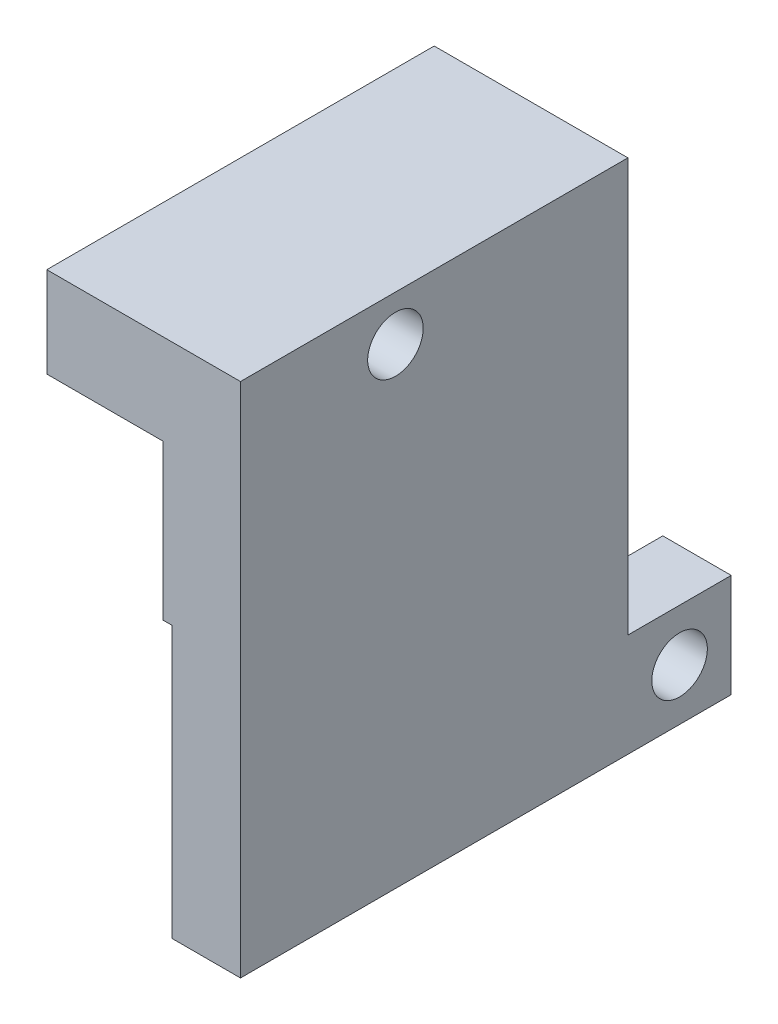
ISO-10303-21;
HEADER;
FILE_DESCRIPTION(('STEP AP214'),'2;1');
FILE_NAME('part.step','',(''),(''),'','','');
FILE_SCHEMA(('AUTOMOTIVE_DESIGN { 1 0 10303 214 1 1 1 1 }'));
ENDSEC;
DATA;
#1=APPLICATION_CONTEXT('core data for automotive mechanical design processes');
#2=APPLICATION_PROTOCOL_DEFINITION('international standard','automotive_design',2000,#1);
#3=PRODUCT_CONTEXT('',#1,'mechanical');
#4=PRODUCT('Part','Part','',(#3));
#5=PRODUCT_RELATED_PRODUCT_CATEGORY('part','',(#4));
#6=PRODUCT_DEFINITION_FORMATION('','',#4);
#7=PRODUCT_DEFINITION_CONTEXT('part definition',#1,'design');
#8=PRODUCT_DEFINITION('design','',#6,#7);
#9=PRODUCT_DEFINITION_SHAPE('','',#8);
#10=(LENGTH_UNIT() NAMED_UNIT(*) SI_UNIT(.MILLI.,.METRE.));
#11=(NAMED_UNIT(*) PLANE_ANGLE_UNIT() SI_UNIT($,.RADIAN.));
#12=(NAMED_UNIT(*) SI_UNIT($,.STERADIAN.) SOLID_ANGLE_UNIT());
#13=UNCERTAINTY_MEASURE_WITH_UNIT(LENGTH_MEASURE(1.E-05),#10,'distance_accuracy_value','');
#14=(GEOMETRIC_REPRESENTATION_CONTEXT(3) GLOBAL_UNCERTAINTY_ASSIGNED_CONTEXT((#13)) GLOBAL_UNIT_ASSIGNED_CONTEXT((#10,
#11,#12)) REPRESENTATION_CONTEXT('',''));
#15=CARTESIAN_POINT('',(0.,0.,0.));
#16=DIRECTION('',(0.,0.,1.));
#17=DIRECTION('',(1.,0.,0.));
#18=AXIS2_PLACEMENT_3D('',#15,#16,#17);
#19=CARTESIAN_POINT('',(4.83870967741938,-20.,0.));
#20=DIRECTION('',(0.,1.,0.));
#21=DIRECTION('',(0.,0.,1.));
#22=AXIS2_PLACEMENT_3D('',#19,#20,#21);
#23=PLANE('',#22);
#24=DIRECTION('',(1.,0.,0.));
#25=VECTOR('',#24,1.);
#26=CARTESIAN_POINT('',(11.4193548387097,-20.,-39.4516129032258));
#27=LINE('',#26,#25);
#28=CARTESIAN_POINT('',(12.1193548387097,-20.,-39.4516129032258));
#29=VERTEX_POINT('',#28);
#30=CARTESIAN_POINT('',(17.4193548387097,-20.,-39.4516129032258));
#31=VERTEX_POINT('',#30);
#32=EDGE_CURVE('E143',#29,#31,#27,.T.);
#33=ORIENTED_EDGE('',*,*,#32,.T.);
#34=DIRECTION('',(0.,0.,1.));
#35=VECTOR('',#34,1.);
#36=CARTESIAN_POINT('',(17.4193548387097,-20.,-31.4516129032258));
#37=LINE('',#36,#35);
#38=CARTESIAN_POINT('',(17.4193548387097,-20.,-1.45161290322579));
#39=VERTEX_POINT('',#38);
#40=EDGE_CURVE('E192',#31,#39,#37,.T.);
#41=ORIENTED_EDGE('',*,*,#40,.T.);
#42=DIRECTION('',(1.,0.,0.));
#43=VECTOR('',#42,1.);
#44=CARTESIAN_POINT('',(2.41835483870969,-20.,-1.45161290322578));
#45=LINE('',#44,#43);
#46=CARTESIAN_POINT('',(12.1193548387097,-20.,-1.45161290322579));
#47=VERTEX_POINT('',#46);
#48=EDGE_CURVE('E145',#47,#39,#45,.T.);
#49=ORIENTED_EDGE('',*,*,#48,.F.);
#50=DIRECTION('',(0.,0.,-1.));
#51=VECTOR('',#50,1.);
#52=CARTESIAN_POINT('',(12.1193548387097,-20.,-31.4516129032258));
#53=LINE('',#52,#51);
#54=EDGE_CURVE('E130',#47,#29,#53,.T.);
#55=ORIENTED_EDGE('',*,*,#54,.T.);
#56=EDGE_LOOP('',(#33,#41,#49,#55));
#57=FACE_BOUND('',#56,.T.);
#58=ADVANCED_FACE('F45',(#57),#23,.F.);
#59=CARTESIAN_POINT('',(11.4193548387097,-12.,-39.4516129032258));
#60=DIRECTION('',(0.,-1.,0.));
#61=DIRECTION('',(0.,0.,-1.));
#62=AXIS2_PLACEMENT_3D('',#59,#60,#61);
#63=PLANE('',#62);
#64=DIRECTION('',(0.,0.,1.));
#65=VECTOR('',#64,1.);
#66=CARTESIAN_POINT('',(12.1193548387097,-12.,-31.4516129032258));
#67=LINE('',#66,#65);
#68=CARTESIAN_POINT('',(12.1193548387097,-12.,-39.4516129032258));
#69=VERTEX_POINT('',#68);
#70=CARTESIAN_POINT('',(12.1193548387097,-12.,-31.4516129032258));
#71=VERTEX_POINT('',#70);
#72=EDGE_CURVE('E133',#69,#71,#67,.T.);
#73=ORIENTED_EDGE('',*,*,#72,.T.);
#74=DIRECTION('',(-1.,0.,0.));
#75=VECTOR('',#74,1.);
#76=CARTESIAN_POINT('',(11.4193548387097,-12.,-31.4516129032258));
#77=LINE('',#76,#75);
#78=CARTESIAN_POINT('',(17.4193548387097,-12.,-31.4516129032258));
#79=VERTEX_POINT('',#78);
#80=EDGE_CURVE('E153',#79,#71,#77,.T.);
#81=ORIENTED_EDGE('',*,*,#80,.F.);
#82=DIRECTION('',(0.,0.,1.));
#83=VECTOR('',#82,1.);
#84=CARTESIAN_POINT('',(17.4193548387097,-12.,-39.4516129032258));
#85=LINE('',#84,#83);
#86=CARTESIAN_POINT('',(17.4193548387097,-12.,-39.4516129032258));
#87=VERTEX_POINT('',#86);
#88=EDGE_CURVE('E166',#87,#79,#85,.T.);
#89=ORIENTED_EDGE('',*,*,#88,.F.);
#90=DIRECTION('',(-1.,0.,0.));
#91=VECTOR('',#90,1.);
#92=CARTESIAN_POINT('',(11.4193548387097,-12.,-39.4516129032258));
#93=LINE('',#92,#91);
#94=EDGE_CURVE('E157',#87,#69,#93,.T.);
#95=ORIENTED_EDGE('',*,*,#94,.T.);
#96=EDGE_LOOP('',(#73,#81,#89,#95));
#97=FACE_BOUND('',#96,.T.);
#98=ADVANCED_FACE('F303',(#97),#63,.F.);
#99=CARTESIAN_POINT('',(4.83870967741938,0.,-39.4516129032258));
#100=DIRECTION('',(0.,0.,-1.));
#101=DIRECTION('',(1.,0.,0.));
#102=AXIS2_PLACEMENT_3D('',#99,#100,#101);
#103=PLANE('',#102);
#104=ORIENTED_EDGE('',*,*,#94,.F.);
#105=DIRECTION('',(0.,1.,0.));
#106=VECTOR('',#105,1.);
#107=CARTESIAN_POINT('',(17.4193548387097,-12.,-39.4516129032258));
#108=LINE('',#107,#106);
#109=EDGE_CURVE('E150',#31,#87,#108,.T.);
#110=ORIENTED_EDGE('',*,*,#109,.F.);
#111=ORIENTED_EDGE('',*,*,#32,.F.);
#112=DIRECTION('',(0.,1.,0.));
#113=VECTOR('',#112,1.);
#114=CARTESIAN_POINT('',(12.1193548387097,-12.,-39.4516129032258));
#115=LINE('',#114,#113);
#116=EDGE_CURVE('E126',#29,#69,#115,.T.);
#117=ORIENTED_EDGE('',*,*,#116,.T.);
#118=EDGE_LOOP('',(#104,#110,#111,#117));
#119=FACE_BOUND('',#118,.T.);
#120=ADVANCED_FACE('F149',(#119),#103,.T.);
#121=CARTESIAN_POINT('',(2.41935483870969,-16.,-35.4516129032258));
#122=DIRECTION('',(1.,0.,0.));
#123=DIRECTION('',(0.,0.,1.));
#124=AXIS2_PLACEMENT_3D('',#121,#122,#123);
#125=CYLINDRICAL_SURFACE('',#124,2.15);
#126=CARTESIAN_POINT('',(17.4193548387097,-16.,-35.4516129032258));
#127=DIRECTION('',(-1.,0.,0.));
#128=DIRECTION('',(0.,0.,1.));
#129=AXIS2_PLACEMENT_3D('',#126,#127,#128);
#130=CIRCLE('',#129,2.15);
#131=CARTESIAN_POINT('',(17.4193548387097,-16.,-33.3016129032258));
#132=VERTEX_POINT('',#131);
#133=EDGE_CURVE('E160',#132,#132,#130,.T.);
#134=ORIENTED_EDGE('',*,*,#133,.F.);
#135=EDGE_LOOP('',(#134));
#136=FACE_BOUND('',#135,.T.);
#137=CARTESIAN_POINT('',(12.1193548387097,-16.,-35.4516129032258));
#138=DIRECTION('',(1.,0.,0.));
#139=DIRECTION('',(0.,0.,-1.));
#140=AXIS2_PLACEMENT_3D('',#137,#138,#139);
#141=CIRCLE('',#140,2.15);
#142=CARTESIAN_POINT('',(12.1193548387097,-16.,-37.6016129032258));
#143=VERTEX_POINT('',#142);
#144=EDGE_CURVE('E260',#143,#143,#141,.F.);
#145=ORIENTED_EDGE('',*,*,#144,.T.);
#146=EDGE_LOOP('',(#145));
#147=FACE_BOUND('',#146,.T.);
#148=ADVANCED_FACE('F253',(#136,#147),#125,.F.);
#149=CARTESIAN_POINT('',(11.4193548387097,20.,-31.4516129032258));
#150=DIRECTION('',(1.,0.,0.));
#151=DIRECTION('',(0.,0.,1.));
#152=AXIS2_PLACEMENT_3D('',#149,#150,#151);
#153=PLANE('',#152);
#154=DIRECTION('',(0.,1.,0.));
#155=VECTOR('',#154,1.);
#156=CARTESIAN_POINT('',(11.4193548387097,20.,-1.4516129032258));
#157=LINE('',#156,#155);
#158=CARTESIAN_POINT('',(11.4193548387097,0.999999999999997,-1.45161290322578));
#159=VERTEX_POINT('',#158);
#160=CARTESIAN_POINT('',(11.4193548387097,13.,-1.45161290322579));
#161=VERTEX_POINT('',#160);
#162=EDGE_CURVE('E216',#159,#161,#157,.T.);
#163=ORIENTED_EDGE('',*,*,#162,.T.);
#164=DIRECTION('',(0.,0.,-1.));
#165=VECTOR('',#164,1.);
#166=CARTESIAN_POINT('',(11.4193548387097,13.,3.5483870967742));
#167=LINE('',#166,#165);
#168=CARTESIAN_POINT('',(11.4193548387097,13.,-21.4516129032258));
#169=VERTEX_POINT('',#168);
#170=EDGE_CURVE('E176',#161,#169,#167,.T.);
#171=ORIENTED_EDGE('',*,*,#170,.T.);
#172=DIRECTION('',(0.,1.,0.));
#173=VECTOR('',#172,1.);
#174=CARTESIAN_POINT('',(11.4193548387097,1.,-21.4516129032258));
#175=LINE('',#174,#173);
#176=CARTESIAN_POINT('',(11.4193548387097,1.,-21.4516129032258));
#177=VERTEX_POINT('',#176);
#178=EDGE_CURVE('E236',#177,#169,#175,.T.);
#179=ORIENTED_EDGE('',*,*,#178,.F.);
#180=DIRECTION('',(0.,0.,1.));
#181=VECTOR('',#180,1.);
#182=CARTESIAN_POINT('',(11.4193548387097,1.,-31.4516129032258));
#183=LINE('',#182,#181);
#184=EDGE_CURVE('E262',#177,#159,#183,.T.);
#185=ORIENTED_EDGE('',*,*,#184,.T.);
#186=EDGE_LOOP('',(#163,#171,#179,#185));
#187=FACE_BOUND('',#186,.T.);
#188=ADVANCED_FACE('F256',(#187),#153,.F.);
#189=CARTESIAN_POINT('',(2.41935483870969,13.,3.5483870967742));
#190=DIRECTION('',(0.,1.,0.));
#191=DIRECTION('',(0.,0.,1.));
#192=AXIS2_PLACEMENT_3D('',#189,#190,#191);
#193=PLANE('',#192);
#194=DIRECTION('',(0.,0.,-1.));
#195=VECTOR('',#194,1.);
#196=CARTESIAN_POINT('',(2.41935483870969,13.,3.5483870967742));
#197=LINE('',#196,#195);
#198=CARTESIAN_POINT('',(2.41935483870969,13.,-1.45161290322579));
#199=VERTEX_POINT('',#198);
#200=CARTESIAN_POINT('',(2.41935483870969,13.,-21.4516129032258));
#201=VERTEX_POINT('',#200);
#202=EDGE_CURVE('E180',#199,#201,#197,.T.);
#203=ORIENTED_EDGE('',*,*,#202,.T.);
#204=DIRECTION('',(1.,0.,0.));
#205=VECTOR('',#204,1.);
#206=CARTESIAN_POINT('',(2.41935483870969,13.,-21.4516129032258));
#207=LINE('',#206,#205);
#208=EDGE_CURVE('E224',#201,#169,#207,.T.);
#209=ORIENTED_EDGE('',*,*,#208,.T.);
#210=ORIENTED_EDGE('',*,*,#170,.F.);
#211=DIRECTION('',(-1.,0.,0.));
#212=VECTOR('',#211,1.);
#213=CARTESIAN_POINT('',(2.41835483870969,13.,-1.45161290322579));
#214=LINE('',#213,#212);
#215=EDGE_CURVE('E212',#161,#199,#214,.T.);
#216=ORIENTED_EDGE('',*,*,#215,.T.);
#217=EDGE_LOOP('',(#203,#209,#210,#216));
#218=FACE_BOUND('',#217,.T.);
#219=ADVANCED_FACE('F291',(#218),#193,.F.);
#220=CARTESIAN_POINT('',(17.4193548387097,20.,-31.4516129032258));
#221=DIRECTION('',(0.,0.,1.));
#222=DIRECTION('',(-1.,0.,0.));
#223=AXIS2_PLACEMENT_3D('',#220,#221,#222);
#224=PLANE('',#223);
#225=DIRECTION('',(-1.,0.,0.));
#226=VECTOR('',#225,1.);
#227=CARTESIAN_POINT('',(2.41935483870969,1.,-31.4516129032258));
#228=LINE('',#227,#226);
#229=CARTESIAN_POINT('',(12.1193548387097,1.,-31.4516129032258));
#230=VERTEX_POINT('',#229);
#231=CARTESIAN_POINT('',(2.41935483870969,1.,-31.4516129032258));
#232=VERTEX_POINT('',#231);
#233=EDGE_CURVE('E232',#230,#232,#228,.T.);
#234=ORIENTED_EDGE('',*,*,#233,.T.);
#235=DIRECTION('',(0.,1.,0.));
#236=VECTOR('',#235,1.);
#237=CARTESIAN_POINT('',(2.41935483870969,20.,-31.4516129032258));
#238=LINE('',#237,#236);
#239=CARTESIAN_POINT('',(2.41935483870969,20.,-31.4516129032258));
#240=VERTEX_POINT('',#239);
#241=EDGE_CURVE('E184',#232,#240,#238,.T.);
#242=ORIENTED_EDGE('',*,*,#241,.T.);
#243=DIRECTION('',(1.,0.,0.));
#244=VECTOR('',#243,1.);
#245=CARTESIAN_POINT('',(17.4193548387097,20.,-31.4516129032258));
#246=LINE('',#245,#244);
#247=CARTESIAN_POINT('',(17.4193548387097,20.,-31.4516129032258));
#248=VERTEX_POINT('',#247);
#249=EDGE_CURVE('E54',#240,#248,#246,.T.);
#250=ORIENTED_EDGE('',*,*,#249,.T.);
#251=DIRECTION('',(0.,-1.,0.));
#252=VECTOR('',#251,1.);
#253=CARTESIAN_POINT('',(17.4193548387097,20.,-31.4516129032258));
#254=LINE('',#253,#252);
#255=EDGE_CURVE('E11',#248,#79,#254,.T.);
#256=ORIENTED_EDGE('',*,*,#255,.T.);
#257=ORIENTED_EDGE('',*,*,#80,.T.);
#258=DIRECTION('',(0.,1.,0.));
#259=VECTOR('',#258,1.);
#260=CARTESIAN_POINT('',(12.1193548387097,1.,-31.4516129032258));
#261=LINE('',#260,#259);
#262=EDGE_CURVE('E267',#71,#230,#261,.T.);
#263=ORIENTED_EDGE('',*,*,#262,.T.);
#264=EDGE_LOOP('',(#234,#242,#250,#256,#257,#263));
#265=FACE_BOUND('',#264,.T.);
#266=ADVANCED_FACE('F299',(#265),#224,.F.);
#267=CARTESIAN_POINT('',(17.4193548387097,20.,-31.4516129032258));
#268=DIRECTION('',(-1.,0.,0.));
#269=DIRECTION('',(0.,0.,-1.));
#270=AXIS2_PLACEMENT_3D('',#267,#268,#269);
#271=PLANE('',#270);
#272=ORIENTED_EDGE('',*,*,#133,.T.);
#273=EDGE_LOOP('',(#272));
#274=FACE_BOUND('',#273,.T.);
#275=CARTESIAN_POINT('',(17.4193548387097,16.5,-13.4516129032258));
#276=DIRECTION('',(1.,0.,0.));
#277=DIRECTION('',(0.,0.,-1.));
#278=AXIS2_PLACEMENT_3D('',#275,#276,#277);
#279=CIRCLE('',#278,2.15);
#280=CARTESIAN_POINT('',(17.4193548387097,16.5,-15.6016129032258));
#281=VERTEX_POINT('',#280);
#282=EDGE_CURVE('E172',#281,#281,#279,.T.);
#283=ORIENTED_EDGE('',*,*,#282,.F.);
#284=EDGE_LOOP('',(#283));
#285=FACE_BOUND('',#284,.T.);
#286=ORIENTED_EDGE('',*,*,#40,.F.);
#287=ORIENTED_EDGE('',*,*,#109,.T.);
#288=ORIENTED_EDGE('',*,*,#88,.T.);
#289=ORIENTED_EDGE('',*,*,#255,.F.);
#290=DIRECTION('',(0.,0.,1.));
#291=VECTOR('',#290,1.);
#292=CARTESIAN_POINT('',(17.4193548387097,20.,-31.4516129032258));
#293=LINE('',#292,#291);
#294=CARTESIAN_POINT('',(17.4193548387097,20.,-1.4516129032258));
#295=VERTEX_POINT('',#294);
#296=EDGE_CURVE('E196',#248,#295,#293,.T.);
#297=ORIENTED_EDGE('',*,*,#296,.T.);
#298=DIRECTION('',(0.,-1.,0.));
#299=VECTOR('',#298,1.);
#300=CARTESIAN_POINT('',(17.4193548387097,20.,-1.4516129032258));
#301=LINE('',#300,#299);
#302=EDGE_CURVE('E205',#295,#39,#301,.T.);
#303=ORIENTED_EDGE('',*,*,#302,.T.);
#304=EDGE_LOOP('',(#286,#287,#288,#289,#297,#303));
#305=FACE_BOUND('',#304,.T.);
#306=ADVANCED_FACE('F47',(#274,#285,#305),#271,.F.);
#307=CARTESIAN_POINT('',(4.83870967741938,20.,0.));
#308=DIRECTION('',(0.,1.,0.));
#309=DIRECTION('',(0.,0.,1.));
#310=AXIS2_PLACEMENT_3D('',#307,#308,#309);
#311=PLANE('',#310);
#312=DIRECTION('',(1.,0.,0.));
#313=VECTOR('',#312,1.);
#314=CARTESIAN_POINT('',(2.41835483870969,20.,-1.45161290322579));
#315=LINE('',#314,#313);
#316=CARTESIAN_POINT('',(2.41935483870969,20.,-1.45161290322579));
#317=VERTEX_POINT('',#316);
#318=EDGE_CURVE('E208',#317,#295,#315,.T.);
#319=ORIENTED_EDGE('',*,*,#318,.T.);
#320=ORIENTED_EDGE('',*,*,#296,.F.);
#321=ORIENTED_EDGE('',*,*,#249,.F.);
#322=DIRECTION('',(0.,0.,1.));
#323=VECTOR('',#322,1.);
#324=CARTESIAN_POINT('',(2.41935483870969,20.,3.54838709677421));
#325=LINE('',#324,#323);
#326=EDGE_CURVE('E188',#240,#317,#325,.T.);
#327=ORIENTED_EDGE('',*,*,#326,.T.);
#328=EDGE_LOOP('',(#319,#320,#321,#327));
#329=FACE_BOUND('',#328,.T.);
#330=ADVANCED_FACE('F305',(#329),#311,.T.);
#331=CARTESIAN_POINT('',(2.41935483870969,0.,0.));
#332=DIRECTION('',(-1.,0.,0.));
#333=DIRECTION('',(0.,0.,-1.));
#334=AXIS2_PLACEMENT_3D('',#331,#332,#333);
#335=PLANE('',#334);
#336=DIRECTION('',(0.,-1.,0.));
#337=VECTOR('',#336,1.);
#338=CARTESIAN_POINT('',(2.41935483870969,20.,-1.45161290322579));
#339=LINE('',#338,#337);
#340=EDGE_CURVE('E69',#317,#199,#339,.T.);
#341=ORIENTED_EDGE('',*,*,#340,.F.);
#342=ORIENTED_EDGE('',*,*,#326,.F.);
#343=ORIENTED_EDGE('',*,*,#241,.F.);
#344=DIRECTION('',(0.,0.,1.));
#345=VECTOR('',#344,1.);
#346=CARTESIAN_POINT('',(2.41935483870969,1.,-31.4516129032258));
#347=LINE('',#346,#345);
#348=CARTESIAN_POINT('',(2.41935483870969,1.,-21.4516129032258));
#349=VERTEX_POINT('',#348);
#350=EDGE_CURVE('E225',#232,#349,#347,.T.);
#351=ORIENTED_EDGE('',*,*,#350,.T.);
#352=DIRECTION('',(0.,1.,0.));
#353=VECTOR('',#352,1.);
#354=CARTESIAN_POINT('',(2.41935483870969,1.,-21.4516129032258));
#355=LINE('',#354,#353);
#356=EDGE_CURVE('E241',#349,#201,#355,.T.);
#357=ORIENTED_EDGE('',*,*,#356,.T.);
#358=ORIENTED_EDGE('',*,*,#202,.F.);
#359=EDGE_LOOP('',(#341,#342,#343,#351,#357,#358));
#360=FACE_BOUND('',#359,.T.);
#361=CARTESIAN_POINT('',(2.41935483870969,16.5,-13.4516129032258));
#362=DIRECTION('',(1.,0.,0.));
#363=DIRECTION('',(0.,0.,-1.));
#364=AXIS2_PLACEMENT_3D('',#361,#362,#363);
#365=CIRCLE('',#364,2.15);
#366=CARTESIAN_POINT('',(2.41935483870969,16.5,-15.6016129032258));
#367=VERTEX_POINT('',#366);
#368=EDGE_CURVE('E171',#367,#367,#365,.T.);
#369=ORIENTED_EDGE('',*,*,#368,.T.);
#370=EDGE_LOOP('',(#369));
#371=FACE_BOUND('',#370,.T.);
#372=ADVANCED_FACE('F295',(#360,#371),#335,.T.);
#373=CARTESIAN_POINT('',(17.4193548387097,16.5,-13.4516129032258));
#374=DIRECTION('',(-1.,0.,0.));
#375=DIRECTION('',(0.,0.,-1.));
#376=AXIS2_PLACEMENT_3D('',#373,#374,#375);
#377=CYLINDRICAL_SURFACE('',#376,2.15);
#378=ORIENTED_EDGE('',*,*,#282,.T.);
#379=EDGE_LOOP('',(#378));
#380=FACE_BOUND('',#379,.T.);
#381=ORIENTED_EDGE('',*,*,#368,.F.);
#382=EDGE_LOOP('',(#381));
#383=FACE_BOUND('',#382,.T.);
#384=ADVANCED_FACE('F312',(#380,#383),#377,.F.);
#385=CARTESIAN_POINT('',(2.41935483870969,1.,-21.4516129032258));
#386=DIRECTION('',(0.,0.,-1.));
#387=DIRECTION('',(1.,0.,0.));
#388=AXIS2_PLACEMENT_3D('',#385,#386,#387);
#389=PLANE('',#388);
#390=ORIENTED_EDGE('',*,*,#208,.F.);
#391=ORIENTED_EDGE('',*,*,#356,.F.);
#392=DIRECTION('',(1.,0.,0.));
#393=VECTOR('',#392,1.);
#394=CARTESIAN_POINT('',(2.41935483870969,1.,-21.4516129032258));
#395=LINE('',#394,#393);
#396=EDGE_CURVE('E229',#349,#177,#395,.T.);
#397=ORIENTED_EDGE('',*,*,#396,.T.);
#398=ORIENTED_EDGE('',*,*,#178,.T.);
#399=EDGE_LOOP('',(#390,#391,#397,#398));
#400=FACE_BOUND('',#399,.T.);
#401=ADVANCED_FACE('F293',(#400),#389,.F.);
#402=CARTESIAN_POINT('',(4.83870967741938,1.,0.));
#403=DIRECTION('',(0.,-1.,0.));
#404=DIRECTION('',(0.,0.,-1.));
#405=AXIS2_PLACEMENT_3D('',#402,#403,#404);
#406=PLANE('',#405);
#407=ORIENTED_EDGE('',*,*,#350,.F.);
#408=ORIENTED_EDGE('',*,*,#233,.F.);
#409=DIRECTION('',(0.,0.,1.));
#410=VECTOR('',#409,1.);
#411=CARTESIAN_POINT('',(12.1193548387097,1.,-31.4516129032258));
#412=LINE('',#411,#410);
#413=CARTESIAN_POINT('',(12.1193548387097,1.,-1.45161290322579));
#414=VERTEX_POINT('',#413);
#415=EDGE_CURVE('E274',#230,#414,#412,.T.);
#416=ORIENTED_EDGE('',*,*,#415,.T.);
#417=DIRECTION('',(-1.,0.,0.));
#418=VECTOR('',#417,1.);
#419=CARTESIAN_POINT('',(12.1193548387097,0.999999999999997,-1.45161290322578));
#420=LINE('',#419,#418);
#421=EDGE_CURVE('E147',#414,#159,#420,.T.);
#422=ORIENTED_EDGE('',*,*,#421,.T.);
#423=ORIENTED_EDGE('',*,*,#184,.F.);
#424=ORIENTED_EDGE('',*,*,#396,.F.);
#425=EDGE_LOOP('',(#407,#408,#416,#422,#423,#424));
#426=FACE_BOUND('',#425,.T.);
#427=ADVANCED_FACE('F284',(#426),#406,.T.);
#428=CARTESIAN_POINT('',(2.41835483870969,20.,-1.45161290322579));
#429=DIRECTION('',(0.,0.,-1.));
#430=DIRECTION('',(0.,1.,0.));
#431=AXIS2_PLACEMENT_3D('',#428,#429,#430);
#432=PLANE('',#431);
#433=DIRECTION('',(0.,-1.,0.));
#434=VECTOR('',#433,1.);
#435=CARTESIAN_POINT('',(12.1193548387097,0.999999999999997,-1.45161290322578));
#436=LINE('',#435,#434);
#437=EDGE_CURVE('E61',#414,#47,#436,.T.);
#438=ORIENTED_EDGE('',*,*,#437,.T.);
#439=ORIENTED_EDGE('',*,*,#48,.T.);
#440=ORIENTED_EDGE('',*,*,#302,.F.);
#441=ORIENTED_EDGE('',*,*,#318,.F.);
#442=ORIENTED_EDGE('',*,*,#340,.T.);
#443=ORIENTED_EDGE('',*,*,#215,.F.);
#444=ORIENTED_EDGE('',*,*,#162,.F.);
#445=ORIENTED_EDGE('',*,*,#421,.F.);
#446=EDGE_LOOP('',(#438,#439,#440,#441,#442,#443,#444,#445));
#447=FACE_BOUND('',#446,.T.);
#448=ADVANCED_FACE('F210',(#447),#432,.F.);
#449=CARTESIAN_POINT('',(12.1193548387097,0.,0.));
#450=DIRECTION('',(1.,0.,0.));
#451=DIRECTION('',(0.,0.,1.));
#452=AXIS2_PLACEMENT_3D('',#449,#450,#451);
#453=PLANE('',#452);
#454=ORIENTED_EDGE('',*,*,#54,.F.);
#455=ORIENTED_EDGE('',*,*,#437,.F.);
#456=ORIENTED_EDGE('',*,*,#415,.F.);
#457=ORIENTED_EDGE('',*,*,#262,.F.);
#458=ORIENTED_EDGE('',*,*,#72,.F.);
#459=ORIENTED_EDGE('',*,*,#116,.F.);
#460=EDGE_LOOP('',(#454,#455,#456,#457,#458,#459));
#461=FACE_BOUND('',#460,.T.);
#462=ORIENTED_EDGE('',*,*,#144,.F.);
#463=EDGE_LOOP('',(#462));
#464=FACE_BOUND('',#463,.T.);
#465=ADVANCED_FACE('F128',(#461,#464),#453,.F.);
#466=CLOSED_SHELL('',(#58,#98,#120,#148,#188,#219,#266,#306,#330,#372,#384,#401,#427,#448,#465));
#467=MANIFOLD_SOLID_BREP('B2',#466);
#468=ADVANCED_BREP_SHAPE_REPRESENTATION('',(#18,#467),#14);
#469=SHAPE_DEFINITION_REPRESENTATION(#9,#468);
ENDSEC;
END-ISO-10303-21;
